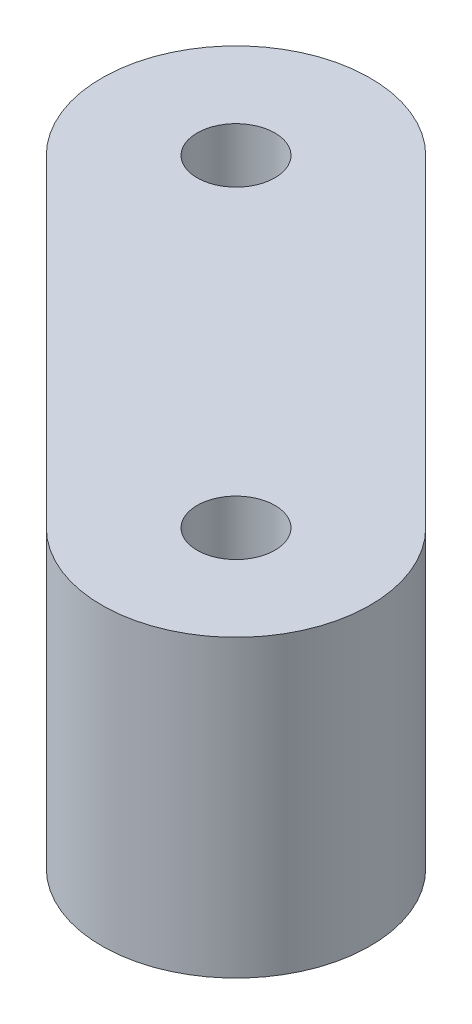
ISO-10303-21;
HEADER;
FILE_DESCRIPTION(('STEP AP214'),'2;1');
FILE_NAME('part.step','',(''),(''),'','','');
FILE_SCHEMA(('AUTOMOTIVE_DESIGN { 1 0 10303 214 1 1 1 1 }'));
ENDSEC;
DATA;
#1=APPLICATION_CONTEXT('core data for automotive mechanical design processes');
#2=APPLICATION_PROTOCOL_DEFINITION('international standard','automotive_design',2000,#1);
#3=PRODUCT_CONTEXT('',#1,'mechanical');
#4=PRODUCT('Part','Part','',(#3));
#5=PRODUCT_RELATED_PRODUCT_CATEGORY('part','',(#4));
#6=PRODUCT_DEFINITION_FORMATION('','',#4);
#7=PRODUCT_DEFINITION_CONTEXT('part definition',#1,'design');
#8=PRODUCT_DEFINITION('design','',#6,#7);
#9=PRODUCT_DEFINITION_SHAPE('','',#8);
#10=(LENGTH_UNIT() NAMED_UNIT(*) SI_UNIT(.MILLI.,.METRE.));
#11=(NAMED_UNIT(*) PLANE_ANGLE_UNIT() SI_UNIT($,.RADIAN.));
#12=(NAMED_UNIT(*) SI_UNIT($,.STERADIAN.) SOLID_ANGLE_UNIT());
#13=UNCERTAINTY_MEASURE_WITH_UNIT(LENGTH_MEASURE(1.E-05),#10,'distance_accuracy_value','');
#14=(GEOMETRIC_REPRESENTATION_CONTEXT(3) GLOBAL_UNCERTAINTY_ASSIGNED_CONTEXT((#13)) GLOBAL_UNIT_ASSIGNED_CONTEXT((#10,
#11,#12)) REPRESENTATION_CONTEXT('',''));
#15=CARTESIAN_POINT('',(0.,0.,0.));
#16=DIRECTION('',(0.,0.,1.));
#17=DIRECTION('',(1.,0.,0.));
#18=AXIS2_PLACEMENT_3D('',#15,#16,#17);
#19=CARTESIAN_POINT('',(-41.7209105962001,-33.4005882909971,93.8370490960977));
#20=DIRECTION('',(0.,1.,0.));
#21=DIRECTION('',(0.,0.,1.));
#22=AXIS2_PLACEMENT_3D('',#19,#20,#21);
#23=PLANE('',#22);
#24=CARTESIAN_POINT('',(-29.7000953160288,-33.4005882909971,105.857864376269));
#25=DIRECTION('',(0.,-1.,0.));
#26=DIRECTION('',(0.,0.,-1.));
#27=AXIS2_PLACEMENT_3D('',#24,#25,#26);
#28=CIRCLE('',#27,1.45);
#29=CARTESIAN_POINT('',(-29.7000953160288,-33.4005882909971,104.407864376269));
#30=VERTEX_POINT('',#29);
#31=EDGE_CURVE('E162',#30,#30,#28,.T.);
#32=ORIENTED_EDGE('',*,*,#31,.F.);
#33=EDGE_LOOP('',(#32));
#34=FACE_BOUND('',#33,.T.);
#35=DIRECTION('',(0.707106781186546,0.,0.707106781186549));
#36=VECTOR('',#35,1.);
#37=CARTESIAN_POINT('',(-45.2564445021329,-33.4005882909971,97.3725830020304));
#38=LINE('',#37,#36);
#39=CARTESIAN_POINT('',(-36.417609737301,-33.4005882909971,106.211417766862));
#40=VERTEX_POINT('',#39);
#41=CARTESIAN_POINT('',(-33.2356292219616,-33.4005882909971,109.393398282202));
#42=VERTEX_POINT('',#41);
#43=EDGE_CURVE('E143',#40,#42,#38,.T.);
#44=ORIENTED_EDGE('',*,*,#43,.F.);
#45=DIRECTION('',(0.707106781186548,0.,-0.707106781186548));
#46=VECTOR('',#45,1.);
#47=CARTESIAN_POINT('',(-32.8820758313683,-33.4005882909971,102.67588386093));
#48=LINE('',#47,#46);
#49=CARTESIAN_POINT('',(-29.3465419254356,-33.4005882909971,99.1403499549968));
#50=VERTEX_POINT('',#49);
#51=EDGE_CURVE('E40',#40,#50,#48,.T.);
#52=ORIENTED_EDGE('',*,*,#51,.T.);
#53=DIRECTION('',(-0.707106781186547,0.,-0.707106781186549));
#54=VECTOR('',#53,1.);
#55=CARTESIAN_POINT('',(-26.1645614100961,-33.4005882909971,102.322330470336));
#56=LINE('',#55,#54);
#57=CARTESIAN_POINT('',(-26.1645614100961,-33.4005882909971,102.322330470336));
#58=VERTEX_POINT('',#57);
#59=EDGE_CURVE('E122',#58,#50,#56,.T.);
#60=ORIENTED_EDGE('',*,*,#59,.F.);
#61=CARTESIAN_POINT('',(-29.7000953160288,-33.4005882909971,105.857864376269));
#62=DIRECTION('',(0.,1.,0.));
#63=DIRECTION('',(0.,0.,1.));
#64=AXIS2_PLACEMENT_3D('',#61,#62,#63);
#65=CIRCLE('',#64,5.);
#66=EDGE_CURVE('E123',#42,#58,#65,.T.);
#67=ORIENTED_EDGE('',*,*,#66,.F.);
#68=EDGE_LOOP('',(#44,#52,#60,#67));
#69=FACE_BOUND('',#68,.T.);
#70=ADVANCED_FACE('F32',(#34,#69),#23,.F.);
#71=CARTESIAN_POINT('',(-41.7209105962001,-22.4005882909971,93.8370490960977));
#72=DIRECTION('',(0.,-1.,0.));
#73=DIRECTION('',(0.,0.,-1.));
#74=AXIS2_PLACEMENT_3D('',#71,#72,#73);
#75=CYLINDRICAL_SURFACE('',#74,5.);
#76=CARTESIAN_POINT('',(-41.7209105962001,-33.4005882909971,93.8370490960977));
#77=DIRECTION('',(0.,1.,0.));
#78=DIRECTION('',(0.,0.,1.));
#79=AXIS2_PLACEMENT_3D('',#76,#77,#78);
#80=CIRCLE('',#79,5.);
#81=CARTESIAN_POINT('',(-38.1853766902674,-33.4005882909971,90.3015151901649));
#82=VERTEX_POINT('',#81);
#83=CARTESIAN_POINT('',(-45.2564445021329,-33.4005882909971,97.3725830020304));
#84=VERTEX_POINT('',#83);
#85=EDGE_CURVE('E121',#82,#84,#80,.T.);
#86=ORIENTED_EDGE('',*,*,#85,.T.);
#87=DIRECTION('',(0.,-1.,0.));
#88=VECTOR('',#87,1.);
#89=CARTESIAN_POINT('',(-45.2564445021329,-22.4005882909971,97.3725830020304));
#90=LINE('',#89,#88);
#91=CARTESIAN_POINT('',(-45.2564445021329,-22.4005882909971,97.3725830020304));
#92=VERTEX_POINT('',#91);
#93=EDGE_CURVE('E111',#92,#84,#90,.T.);
#94=ORIENTED_EDGE('',*,*,#93,.F.);
#95=CARTESIAN_POINT('',(-41.7209105962001,-22.4005882909971,93.8370490960977));
#96=DIRECTION('',(0.,1.,0.));
#97=DIRECTION('',(0.,0.,1.));
#98=AXIS2_PLACEMENT_3D('',#95,#96,#97);
#99=CIRCLE('',#98,5.);
#100=CARTESIAN_POINT('',(-38.1853766902674,-22.4005882909971,90.3015151901649));
#101=VERTEX_POINT('',#100);
#102=EDGE_CURVE('E125',#101,#92,#99,.T.);
#103=ORIENTED_EDGE('',*,*,#102,.F.);
#104=DIRECTION('',(0.,-1.,0.));
#105=VECTOR('',#104,1.);
#106=CARTESIAN_POINT('',(-38.1853766902674,-22.4005882909971,90.3015151901649));
#107=LINE('',#106,#105);
#108=EDGE_CURVE('E130',#101,#82,#107,.T.);
#109=ORIENTED_EDGE('',*,*,#108,.T.);
#110=EDGE_LOOP('',(#86,#94,#103,#109));
#111=FACE_BOUND('',#110,.T.);
#112=ADVANCED_FACE('F34',(#111),#75,.T.);
#113=CARTESIAN_POINT('',(-45.2564445021329,-22.4005882909971,97.3725830020304));
#114=DIRECTION('',(0.707106781186549,0.,-0.707106781186546));
#115=DIRECTION('',(-0.707106781186546,0.,-0.707106781186549));
#116=AXIS2_PLACEMENT_3D('',#113,#114,#115);
#117=PLANE('',#116);
#118=DIRECTION('',(0.707106781186546,0.,0.707106781186549));
#119=VECTOR('',#118,1.);
#120=CARTESIAN_POINT('',(-45.2564445021329,-26.4005882909971,97.3725830020304));
#121=LINE('',#120,#119);
#122=CARTESIAN_POINT('',(-42.0744639867934,-26.4005882909971,100.55456351737));
#123=VERTEX_POINT('',#122);
#124=CARTESIAN_POINT('',(-36.417609737301,-26.4005882909971,106.211417766862));
#125=VERTEX_POINT('',#124);
#126=EDGE_CURVE('E166',#123,#125,#121,.T.);
#127=ORIENTED_EDGE('',*,*,#126,.T.);
#128=DIRECTION('',(0.,-1.,0.));
#129=VECTOR('',#128,1.);
#130=CARTESIAN_POINT('',(-36.417609737301,-22.4005882909971,106.211417766862));
#131=LINE('',#130,#129);
#132=EDGE_CURVE('E154',#125,#40,#131,.T.);
#133=ORIENTED_EDGE('',*,*,#132,.T.);
#134=ORIENTED_EDGE('',*,*,#43,.T.);
#135=DIRECTION('',(0.,-1.,0.));
#136=VECTOR('',#135,1.);
#137=CARTESIAN_POINT('',(-33.2356292219616,-22.4005882909971,109.393398282202));
#138=LINE('',#137,#136);
#139=CARTESIAN_POINT('',(-33.2356292219616,-22.4005882909971,109.393398282202));
#140=VERTEX_POINT('',#139);
#141=EDGE_CURVE('E135',#140,#42,#138,.T.);
#142=ORIENTED_EDGE('',*,*,#141,.F.);
#143=DIRECTION('',(0.707106781186546,0.,0.707106781186549));
#144=VECTOR('',#143,1.);
#145=CARTESIAN_POINT('',(-45.2564445021329,-22.4005882909971,97.3725830020304));
#146=LINE('',#145,#144);
#147=EDGE_CURVE('E85',#92,#140,#146,.T.);
#148=ORIENTED_EDGE('',*,*,#147,.F.);
#149=ORIENTED_EDGE('',*,*,#93,.T.);
#150=CARTESIAN_POINT('',(-42.0744639867934,-33.4005882909971,100.55456351737));
#151=VERTEX_POINT('',#150);
#152=EDGE_CURVE('E126',#84,#151,#38,.T.);
#153=ORIENTED_EDGE('',*,*,#152,.T.);
#154=DIRECTION('',(0.,1.,0.));
#155=VECTOR('',#154,1.);
#156=CARTESIAN_POINT('',(-42.0744639867934,-22.4005882909971,100.55456351737));
#157=LINE('',#156,#155);
#158=EDGE_CURVE('E47',#151,#123,#157,.T.);
#159=ORIENTED_EDGE('',*,*,#158,.T.);
#160=EDGE_LOOP('',(#127,#133,#134,#142,#148,#149,#153,#159));
#161=FACE_BOUND('',#160,.T.);
#162=ADVANCED_FACE('F153',(#161),#117,.F.);
#163=CARTESIAN_POINT('',(-29.7000953160288,-22.4005882909971,105.857864376269));
#164=DIRECTION('',(0.,-1.,0.));
#165=DIRECTION('',(0.,0.,-1.));
#166=AXIS2_PLACEMENT_3D('',#163,#164,#165);
#167=CYLINDRICAL_SURFACE('',#166,5.);
#168=ORIENTED_EDGE('',*,*,#66,.T.);
#169=DIRECTION('',(0.,-1.,0.));
#170=VECTOR('',#169,1.);
#171=CARTESIAN_POINT('',(-26.1645614100961,-22.4005882909971,102.322330470336));
#172=LINE('',#171,#170);
#173=CARTESIAN_POINT('',(-26.1645614100961,-22.4005882909971,102.322330470336));
#174=VERTEX_POINT('',#173);
#175=EDGE_CURVE('E132',#174,#58,#172,.T.);
#176=ORIENTED_EDGE('',*,*,#175,.F.);
#177=CARTESIAN_POINT('',(-29.7000953160288,-22.4005882909971,105.857864376269));
#178=DIRECTION('',(0.,1.,0.));
#179=DIRECTION('',(0.,0.,1.));
#180=AXIS2_PLACEMENT_3D('',#177,#178,#179);
#181=CIRCLE('',#180,5.);
#182=EDGE_CURVE('E151',#140,#174,#181,.T.);
#183=ORIENTED_EDGE('',*,*,#182,.F.);
#184=ORIENTED_EDGE('',*,*,#141,.T.);
#185=EDGE_LOOP('',(#168,#176,#183,#184));
#186=FACE_BOUND('',#185,.T.);
#187=ADVANCED_FACE('F150',(#186),#167,.T.);
#188=CARTESIAN_POINT('',(-26.1645614100961,-22.4005882909971,102.322330470336));
#189=DIRECTION('',(-0.707106781186549,0.,0.707106781186546));
#190=DIRECTION('',(0.707106781186546,0.,0.707106781186549));
#191=AXIS2_PLACEMENT_3D('',#188,#189,#190);
#192=PLANE('',#191);
#193=ORIENTED_EDGE('',*,*,#59,.T.);
#194=DIRECTION('',(0.,1.,0.));
#195=VECTOR('',#194,1.);
#196=CARTESIAN_POINT('',(-29.3465419254356,-22.4005882909971,99.1403499549968));
#197=LINE('',#196,#195);
#198=CARTESIAN_POINT('',(-29.3465419254356,-26.4005882909971,99.1403499549968));
#199=VERTEX_POINT('',#198);
#200=EDGE_CURVE('E146',#50,#199,#197,.T.);
#201=ORIENTED_EDGE('',*,*,#200,.T.);
#202=DIRECTION('',(-0.707106781186546,0.,-0.707106781186549));
#203=VECTOR('',#202,1.);
#204=CARTESIAN_POINT('',(-26.1645614100961,-26.4005882909971,102.322330470336));
#205=LINE('',#204,#203);
#206=CARTESIAN_POINT('',(-35.0033961749279,-26.4005882909971,93.4834957055044));
#207=VERTEX_POINT('',#206);
#208=EDGE_CURVE('E11',#199,#207,#205,.T.);
#209=ORIENTED_EDGE('',*,*,#208,.T.);
#210=DIRECTION('',(0.,-1.,0.));
#211=VECTOR('',#210,1.);
#212=CARTESIAN_POINT('',(-35.0033961749279,-22.4005882909971,93.4834957055044));
#213=LINE('',#212,#211);
#214=CARTESIAN_POINT('',(-35.0033961749279,-33.4005882909971,93.4834957055044));
#215=VERTEX_POINT('',#214);
#216=EDGE_CURVE('E107',#207,#215,#213,.T.);
#217=ORIENTED_EDGE('',*,*,#216,.T.);
#218=EDGE_CURVE('E77',#215,#82,#56,.T.);
#219=ORIENTED_EDGE('',*,*,#218,.T.);
#220=ORIENTED_EDGE('',*,*,#108,.F.);
#221=DIRECTION('',(-0.707106781186547,0.,-0.707106781186549));
#222=VECTOR('',#221,1.);
#223=CARTESIAN_POINT('',(-26.1645614100961,-22.4005882909971,102.322330470336));
#224=LINE('',#223,#222);
#225=EDGE_CURVE('E56',#174,#101,#224,.T.);
#226=ORIENTED_EDGE('',*,*,#225,.F.);
#227=ORIENTED_EDGE('',*,*,#175,.T.);
#228=EDGE_LOOP('',(#193,#201,#209,#217,#219,#220,#226,#227));
#229=FACE_BOUND('',#228,.T.);
#230=ADVANCED_FACE('F114',(#229),#192,.F.);
#231=CARTESIAN_POINT('',(-41.7209105962001,-22.4005882909971,93.8370490960977));
#232=DIRECTION('',(0.,1.,0.));
#233=DIRECTION('',(0.,0.,1.));
#234=AXIS2_PLACEMENT_3D('',#231,#232,#233);
#235=PLANE('',#234);
#236=CARTESIAN_POINT('',(-41.7209105962001,-22.4005882909971,93.8370490960977));
#237=DIRECTION('',(0.,-1.,0.));
#238=DIRECTION('',(0.,0.,-1.));
#239=AXIS2_PLACEMENT_3D('',#236,#237,#238);
#240=CIRCLE('',#239,1.45);
#241=CARTESIAN_POINT('',(-41.7209105962001,-22.4005882909971,92.3870490960977));
#242=VERTEX_POINT('',#241);
#243=EDGE_CURVE('E155',#242,#242,#240,.T.);
#244=ORIENTED_EDGE('',*,*,#243,.T.);
#245=EDGE_LOOP('',(#244));
#246=FACE_BOUND('',#245,.T.);
#247=CARTESIAN_POINT('',(-29.7000953160288,-22.4005882909971,105.857864376269));
#248=DIRECTION('',(0.,-1.,0.));
#249=DIRECTION('',(0.,0.,-1.));
#250=AXIS2_PLACEMENT_3D('',#247,#248,#249);
#251=CIRCLE('',#250,1.45);
#252=CARTESIAN_POINT('',(-29.7000953160288,-22.4005882909971,104.407864376269));
#253=VERTEX_POINT('',#252);
#254=EDGE_CURVE('E165',#253,#253,#251,.T.);
#255=ORIENTED_EDGE('',*,*,#254,.T.);
#256=EDGE_LOOP('',(#255));
#257=FACE_BOUND('',#256,.T.);
#258=ORIENTED_EDGE('',*,*,#102,.T.);
#259=ORIENTED_EDGE('',*,*,#147,.T.);
#260=ORIENTED_EDGE('',*,*,#182,.T.);
#261=ORIENTED_EDGE('',*,*,#225,.T.);
#262=EDGE_LOOP('',(#258,#259,#260,#261));
#263=FACE_BOUND('',#262,.T.);
#264=ADVANCED_FACE('F187',(#246,#257,#263),#235,.T.);
#265=CARTESIAN_POINT('',(-41.7209105962001,-33.4005882909971,93.8370490960977));
#266=DIRECTION('',(0.,-1.,0.));
#267=DIRECTION('',(0.,0.,-1.));
#268=AXIS2_PLACEMENT_3D('',#265,#266,#267);
#269=CIRCLE('',#268,1.45);
#270=CARTESIAN_POINT('',(-41.7209105962001,-33.4005882909971,92.3870490960977));
#271=VERTEX_POINT('',#270);
#272=EDGE_CURVE('E169',#271,#271,#269,.T.);
#273=ORIENTED_EDGE('',*,*,#272,.F.);
#274=EDGE_LOOP('',(#273));
#275=FACE_BOUND('',#274,.T.);
#276=ORIENTED_EDGE('',*,*,#218,.F.);
#277=DIRECTION('',(-0.707106781186548,0.,0.707106781186547));
#278=VECTOR('',#277,1.);
#279=CARTESIAN_POINT('',(-38.5389300808607,-33.4005882909971,97.0190296114371));
#280=LINE('',#279,#278);
#281=EDGE_CURVE('E105',#215,#151,#280,.T.);
#282=ORIENTED_EDGE('',*,*,#281,.T.);
#283=ORIENTED_EDGE('',*,*,#152,.F.);
#284=ORIENTED_EDGE('',*,*,#85,.F.);
#285=EDGE_LOOP('',(#276,#282,#283,#284));
#286=FACE_BOUND('',#285,.T.);
#287=ADVANCED_FACE('F119',(#275,#286),#23,.F.);
#288=CARTESIAN_POINT('',(-29.7000953160288,-22.4005882909971,105.857864376269));
#289=DIRECTION('',(0.,-1.,0.));
#290=DIRECTION('',(0.,0.,-1.));
#291=AXIS2_PLACEMENT_3D('',#288,#289,#290);
#292=CYLINDRICAL_SURFACE('',#291,1.45);
#293=ORIENTED_EDGE('',*,*,#254,.F.);
#294=EDGE_LOOP('',(#293));
#295=FACE_BOUND('',#294,.T.);
#296=ORIENTED_EDGE('',*,*,#31,.T.);
#297=EDGE_LOOP('',(#296));
#298=FACE_BOUND('',#297,.T.);
#299=ADVANCED_FACE('F195',(#295,#298),#292,.F.);
#300=CARTESIAN_POINT('',(-41.7209105962001,-22.4005882909971,93.8370490960977));
#301=DIRECTION('',(0.,-1.,0.));
#302=DIRECTION('',(0.,0.,-1.));
#303=AXIS2_PLACEMENT_3D('',#300,#301,#302);
#304=CYLINDRICAL_SURFACE('',#303,1.45);
#305=ORIENTED_EDGE('',*,*,#243,.F.);
#306=EDGE_LOOP('',(#305));
#307=FACE_BOUND('',#306,.T.);
#308=ORIENTED_EDGE('',*,*,#272,.T.);
#309=EDGE_LOOP('',(#308));
#310=FACE_BOUND('',#309,.T.);
#311=ADVANCED_FACE('F241',(#307,#310),#304,.F.);
#312=CARTESIAN_POINT('',(0.,-26.4005882909971,0.));
#313=DIRECTION('',(0.,1.,0.));
#314=DIRECTION('',(0.,0.,1.));
#315=AXIS2_PLACEMENT_3D('',#312,#313,#314);
#316=PLANE('',#315);
#317=DIRECTION('',(0.707106781186548,0.,-0.707106781186547));
#318=VECTOR('',#317,1.);
#319=CARTESIAN_POINT('',(-32.4797823596073,-26.4005882909971,90.9598818901838));
#320=LINE('',#319,#318);
#321=EDGE_CURVE('E180',#123,#207,#320,.T.);
#322=ORIENTED_EDGE('',*,*,#321,.T.);
#323=ORIENTED_EDGE('',*,*,#208,.F.);
#324=DIRECTION('',(-0.707106781186547,0.,0.707106781186547));
#325=VECTOR('',#324,1.);
#326=CARTESIAN_POINT('',(-37.4210971854097,-26.4005882909971,107.214905214971));
#327=LINE('',#326,#325);
#328=EDGE_CURVE('E116',#199,#125,#327,.T.);
#329=ORIENTED_EDGE('',*,*,#328,.T.);
#330=ORIENTED_EDGE('',*,*,#126,.F.);
#331=EDGE_LOOP('',(#322,#323,#329,#330));
#332=FACE_BOUND('',#331,.T.);
#333=ADVANCED_FACE('F182',(#332),#316,.F.);
#334=CARTESIAN_POINT('',(-37.4210971854097,-26.4005882909971,107.214905214971));
#335=DIRECTION('',(0.707106781186548,0.,0.707106781186548));
#336=DIRECTION('',(0.707106781186548,0.,-0.707106781186548));
#337=AXIS2_PLACEMENT_3D('',#334,#335,#336);
#338=PLANE('',#337);
#339=ORIENTED_EDGE('',*,*,#328,.F.);
#340=ORIENTED_EDGE('',*,*,#200,.F.);
#341=ORIENTED_EDGE('',*,*,#51,.F.);
#342=ORIENTED_EDGE('',*,*,#132,.F.);
#343=EDGE_LOOP('',(#339,#340,#341,#342));
#344=FACE_BOUND('',#343,.T.);
#345=ADVANCED_FACE('F240',(#344),#338,.F.);
#346=CARTESIAN_POINT('',(-32.4797823596073,-26.4005882909971,90.9598818901838));
#347=DIRECTION('',(-0.707106781186547,0.,-0.707106781186548));
#348=DIRECTION('',(-0.707106781186548,0.,0.707106781186547));
#349=AXIS2_PLACEMENT_3D('',#346,#347,#348);
#350=PLANE('',#349);
#351=ORIENTED_EDGE('',*,*,#281,.F.);
#352=ORIENTED_EDGE('',*,*,#216,.F.);
#353=ORIENTED_EDGE('',*,*,#321,.F.);
#354=ORIENTED_EDGE('',*,*,#158,.F.);
#355=EDGE_LOOP('',(#351,#352,#353,#354));
#356=FACE_BOUND('',#355,.T.);
#357=ADVANCED_FACE('F106',(#356),#350,.F.);
#358=CLOSED_SHELL('',(#70,#112,#162,#187,#230,#264,#287,#299,#311,#333,#345,#357));
#359=MANIFOLD_SOLID_BREP('B2',#358);
#360=ADVANCED_BREP_SHAPE_REPRESENTATION('',(#18,#359),#14);
#361=SHAPE_DEFINITION_REPRESENTATION(#9,#360);
ENDSEC;
END-ISO-10303-21;
